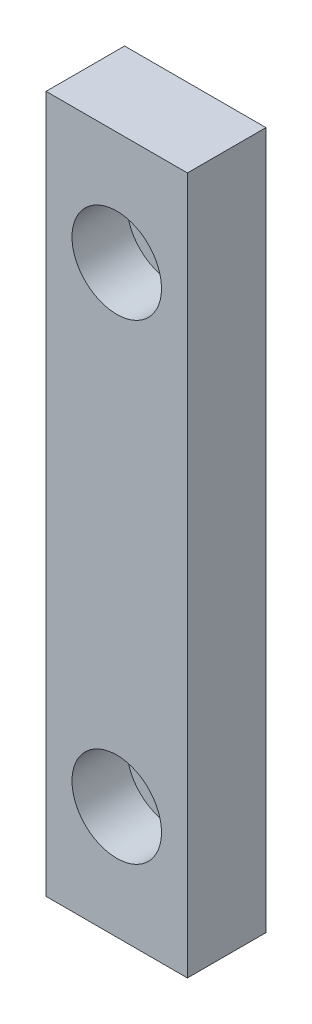
ISO-10303-21;
HEADER;
FILE_DESCRIPTION(('STEP AP214'),'2;1');
FILE_NAME('part.step','',(''),(''),'','','');
FILE_SCHEMA(('AUTOMOTIVE_DESIGN { 1 0 10303 214 1 1 1 1 }'));
ENDSEC;
DATA;
#1=APPLICATION_CONTEXT('core data for automotive mechanical design processes');
#2=APPLICATION_PROTOCOL_DEFINITION('international standard','automotive_design',2000,#1);
#3=PRODUCT_CONTEXT('',#1,'mechanical');
#4=PRODUCT('Part','Part','',(#3));
#5=PRODUCT_RELATED_PRODUCT_CATEGORY('part','',(#4));
#6=PRODUCT_DEFINITION_FORMATION('','',#4);
#7=PRODUCT_DEFINITION_CONTEXT('part definition',#1,'design');
#8=PRODUCT_DEFINITION('design','',#6,#7);
#9=PRODUCT_DEFINITION_SHAPE('','',#8);
#10=(LENGTH_UNIT() NAMED_UNIT(*) SI_UNIT(.MILLI.,.METRE.));
#11=(NAMED_UNIT(*) PLANE_ANGLE_UNIT() SI_UNIT($,.RADIAN.));
#12=(NAMED_UNIT(*) SI_UNIT($,.STERADIAN.) SOLID_ANGLE_UNIT());
#13=UNCERTAINTY_MEASURE_WITH_UNIT(LENGTH_MEASURE(1.E-05),#10,'distance_accuracy_value','');
#14=(GEOMETRIC_REPRESENTATION_CONTEXT(3) GLOBAL_UNCERTAINTY_ASSIGNED_CONTEXT((#13)) GLOBAL_UNIT_ASSIGNED_CONTEXT((#10,
#11,#12)) REPRESENTATION_CONTEXT('',''));
#15=CARTESIAN_POINT('',(0.,0.,0.));
#16=DIRECTION('',(0.,0.,1.));
#17=DIRECTION('',(1.,0.,0.));
#18=AXIS2_PLACEMENT_3D('',#15,#16,#17);
#19=CARTESIAN_POINT('',(0.,22.2,5.));
#20=DIRECTION('',(0.,1.,0.));
#21=DIRECTION('',(0.,0.,1.));
#22=AXIS2_PLACEMENT_3D('',#19,#20,#21);
#23=PLANE('',#22);
#24=DIRECTION('',(1.,0.,0.));
#25=VECTOR('',#24,1.);
#26=CARTESIAN_POINT('',(0.,22.2,0.));
#27=LINE('',#26,#25);
#28=CARTESIAN_POINT('',(-4.5,22.2,0.));
#29=VERTEX_POINT('',#28);
#30=CARTESIAN_POINT('',(4.5,22.2,0.));
#31=VERTEX_POINT('',#30);
#32=EDGE_CURVE('E124',#29,#31,#27,.T.);
#33=ORIENTED_EDGE('',*,*,#32,.F.);
#34=DIRECTION('',(0.,0.,-1.));
#35=VECTOR('',#34,1.);
#36=CARTESIAN_POINT('',(-4.5,22.2,5.));
#37=LINE('',#36,#35);
#38=CARTESIAN_POINT('',(-4.5,22.2,5.));
#39=VERTEX_POINT('',#38);
#40=EDGE_CURVE('E90',#39,#29,#37,.T.);
#41=ORIENTED_EDGE('',*,*,#40,.F.);
#42=DIRECTION('',(1.,0.,0.));
#43=VECTOR('',#42,1.);
#44=CARTESIAN_POINT('',(0.,22.2,5.));
#45=LINE('',#44,#43);
#46=CARTESIAN_POINT('',(4.5,22.2,5.));
#47=VERTEX_POINT('',#46);
#48=EDGE_CURVE('E113',#39,#47,#45,.T.);
#49=ORIENTED_EDGE('',*,*,#48,.T.);
#50=DIRECTION('',(0.,0.,-1.));
#51=VECTOR('',#50,1.);
#52=CARTESIAN_POINT('',(4.5,22.2,5.));
#53=LINE('',#52,#51);
#54=EDGE_CURVE('E87',#47,#31,#53,.T.);
#55=ORIENTED_EDGE('',*,*,#54,.T.);
#56=EDGE_LOOP('',(#33,#41,#49,#55));
#57=FACE_BOUND('',#56,.T.);
#58=ADVANCED_FACE('F45',(#57),#23,.T.);
#59=CARTESIAN_POINT('',(-4.5,0.,5.));
#60=DIRECTION('',(-1.,0.,0.));
#61=DIRECTION('',(0.,0.,1.));
#62=AXIS2_PLACEMENT_3D('',#59,#60,#61);
#63=PLANE('',#62);
#64=DIRECTION('',(0.,1.,0.));
#65=VECTOR('',#64,1.);
#66=CARTESIAN_POINT('',(-4.5,0.,0.));
#67=LINE('',#66,#65);
#68=CARTESIAN_POINT('',(-4.5,-22.2,0.));
#69=VERTEX_POINT('',#68);
#70=EDGE_CURVE('E101',#69,#29,#67,.T.);
#71=ORIENTED_EDGE('',*,*,#70,.F.);
#72=DIRECTION('',(0.,0.,-1.));
#73=VECTOR('',#72,1.);
#74=CARTESIAN_POINT('',(-4.5,-22.2,5.));
#75=LINE('',#74,#73);
#76=CARTESIAN_POINT('',(-4.5,-22.2,5.));
#77=VERTEX_POINT('',#76);
#78=EDGE_CURVE('E95',#77,#69,#75,.T.);
#79=ORIENTED_EDGE('',*,*,#78,.F.);
#80=DIRECTION('',(0.,1.,0.));
#81=VECTOR('',#80,1.);
#82=CARTESIAN_POINT('',(-4.5,0.,5.));
#83=LINE('',#82,#81);
#84=EDGE_CURVE('E99',#77,#39,#83,.T.);
#85=ORIENTED_EDGE('',*,*,#84,.T.);
#86=ORIENTED_EDGE('',*,*,#40,.T.);
#87=EDGE_LOOP('',(#71,#79,#85,#86));
#88=FACE_BOUND('',#87,.T.);
#89=ADVANCED_FACE('F97',(#88),#63,.T.);
#90=CARTESIAN_POINT('',(0.,-22.2,5.));
#91=DIRECTION('',(0.,1.,0.));
#92=DIRECTION('',(0.,0.,1.));
#93=AXIS2_PLACEMENT_3D('',#90,#91,#92);
#94=PLANE('',#93);
#95=DIRECTION('',(1.,0.,0.));
#96=VECTOR('',#95,1.);
#97=CARTESIAN_POINT('',(0.,-22.2,0.));
#98=LINE('',#97,#96);
#99=CARTESIAN_POINT('',(4.5,-22.2,0.));
#100=VERTEX_POINT('',#99);
#101=EDGE_CURVE('E130',#69,#100,#98,.T.);
#102=ORIENTED_EDGE('',*,*,#101,.T.);
#103=DIRECTION('',(0.,0.,-1.));
#104=VECTOR('',#103,1.);
#105=CARTESIAN_POINT('',(4.5,-22.2,5.));
#106=LINE('',#105,#104);
#107=CARTESIAN_POINT('',(4.5,-22.2,5.));
#108=VERTEX_POINT('',#107);
#109=EDGE_CURVE('E105',#108,#100,#106,.T.);
#110=ORIENTED_EDGE('',*,*,#109,.F.);
#111=DIRECTION('',(1.,0.,0.));
#112=VECTOR('',#111,1.);
#113=CARTESIAN_POINT('',(0.,-22.2,5.));
#114=LINE('',#113,#112);
#115=EDGE_CURVE('E108',#77,#108,#114,.T.);
#116=ORIENTED_EDGE('',*,*,#115,.F.);
#117=ORIENTED_EDGE('',*,*,#78,.T.);
#118=EDGE_LOOP('',(#102,#110,#116,#117));
#119=FACE_BOUND('',#118,.T.);
#120=ADVANCED_FACE('F109',(#119),#94,.F.);
#121=CARTESIAN_POINT('',(0.,15.,5.));
#122=DIRECTION('',(0.,0.,-1.));
#123=DIRECTION('',(-1.,0.,0.));
#124=AXIS2_PLACEMENT_3D('',#121,#122,#123);
#125=CYLINDRICAL_SURFACE('',#124,2.85);
#126=CARTESIAN_POINT('',(0.,15.,1.5));
#127=DIRECTION('',(0.,0.,1.));
#128=DIRECTION('',(1.,0.,0.));
#129=AXIS2_PLACEMENT_3D('',#126,#127,#128);
#130=CIRCLE('',#129,2.85);
#131=CARTESIAN_POINT('',(2.85,15.,1.5));
#132=VERTEX_POINT('',#131);
#133=EDGE_CURVE('E11',#132,#132,#130,.T.);
#134=ORIENTED_EDGE('',*,*,#133,.F.);
#135=EDGE_LOOP('',(#134));
#136=FACE_BOUND('',#135,.T.);
#137=CARTESIAN_POINT('',(0.,15.,5.));
#138=DIRECTION('',(0.,0.,1.));
#139=DIRECTION('',(1.,0.,0.));
#140=AXIS2_PLACEMENT_3D('',#137,#138,#139);
#141=CIRCLE('',#140,2.85);
#142=CARTESIAN_POINT('',(2.85,15.,5.));
#143=VERTEX_POINT('',#142);
#144=EDGE_CURVE('E118',#143,#143,#141,.T.);
#145=ORIENTED_EDGE('',*,*,#144,.T.);
#146=EDGE_LOOP('',(#145));
#147=FACE_BOUND('',#146,.T.);
#148=ADVANCED_FACE('F150',(#136,#147),#125,.F.);
#149=CARTESIAN_POINT('',(0.,-15.,5.));
#150=DIRECTION('',(0.,0.,-1.));
#151=DIRECTION('',(-1.,0.,0.));
#152=AXIS2_PLACEMENT_3D('',#149,#150,#151);
#153=CYLINDRICAL_SURFACE('',#152,2.85);
#154=CARTESIAN_POINT('',(0.,-15.,1.5));
#155=DIRECTION('',(0.,0.,1.));
#156=DIRECTION('',(1.,0.,0.));
#157=AXIS2_PLACEMENT_3D('',#154,#155,#156);
#158=CIRCLE('',#157,2.85);
#159=CARTESIAN_POINT('',(2.85,-15.,1.5));
#160=VERTEX_POINT('',#159);
#161=EDGE_CURVE('E55',#160,#160,#158,.T.);
#162=ORIENTED_EDGE('',*,*,#161,.F.);
#163=EDGE_LOOP('',(#162));
#164=FACE_BOUND('',#163,.T.);
#165=CARTESIAN_POINT('',(0.,-15.,5.));
#166=DIRECTION('',(0.,0.,1.));
#167=DIRECTION('',(1.,0.,0.));
#168=AXIS2_PLACEMENT_3D('',#165,#166,#167);
#169=CIRCLE('',#168,2.85);
#170=CARTESIAN_POINT('',(2.85,-15.,5.));
#171=VERTEX_POINT('',#170);
#172=EDGE_CURVE('E135',#171,#171,#169,.T.);
#173=ORIENTED_EDGE('',*,*,#172,.T.);
#174=EDGE_LOOP('',(#173));
#175=FACE_BOUND('',#174,.T.);
#176=ADVANCED_FACE('F47',(#164,#175),#153,.F.);
#177=CARTESIAN_POINT('',(4.5,0.,5.));
#178=DIRECTION('',(-1.,0.,0.));
#179=DIRECTION('',(0.,0.,1.));
#180=AXIS2_PLACEMENT_3D('',#177,#178,#179);
#181=PLANE('',#180);
#182=DIRECTION('',(0.,1.,0.));
#183=VECTOR('',#182,1.);
#184=CARTESIAN_POINT('',(4.5,0.,0.));
#185=LINE('',#184,#183);
#186=EDGE_CURVE('E80',#100,#31,#185,.T.);
#187=ORIENTED_EDGE('',*,*,#186,.T.);
#188=ORIENTED_EDGE('',*,*,#54,.F.);
#189=DIRECTION('',(0.,1.,0.));
#190=VECTOR('',#189,1.);
#191=CARTESIAN_POINT('',(4.5,0.,5.));
#192=LINE('',#191,#190);
#193=EDGE_CURVE('E63',#108,#47,#192,.T.);
#194=ORIENTED_EDGE('',*,*,#193,.F.);
#195=ORIENTED_EDGE('',*,*,#109,.T.);
#196=EDGE_LOOP('',(#187,#188,#194,#195));
#197=FACE_BOUND('',#196,.T.);
#198=ADVANCED_FACE('F149',(#197),#181,.F.);
#199=CARTESIAN_POINT('',(0.,0.,5.));
#200=DIRECTION('',(0.,0.,1.));
#201=DIRECTION('',(1.,0.,0.));
#202=AXIS2_PLACEMENT_3D('',#199,#200,#201);
#203=PLANE('',#202);
#204=ORIENTED_EDGE('',*,*,#172,.F.);
#205=EDGE_LOOP('',(#204));
#206=FACE_BOUND('',#205,.T.);
#207=ORIENTED_EDGE('',*,*,#144,.F.);
#208=EDGE_LOOP('',(#207));
#209=FACE_BOUND('',#208,.T.);
#210=ORIENTED_EDGE('',*,*,#48,.F.);
#211=ORIENTED_EDGE('',*,*,#84,.F.);
#212=ORIENTED_EDGE('',*,*,#115,.T.);
#213=ORIENTED_EDGE('',*,*,#193,.T.);
#214=EDGE_LOOP('',(#210,#211,#212,#213));
#215=FACE_BOUND('',#214,.T.);
#216=ADVANCED_FACE('F112',(#206,#209,#215),#203,.T.);
#217=CARTESIAN_POINT('',(0.,0.,0.));
#218=DIRECTION('',(0.,0.,1.));
#219=DIRECTION('',(1.,0.,0.));
#220=AXIS2_PLACEMENT_3D('',#217,#218,#219);
#221=PLANE('',#220);
#222=ORIENTED_EDGE('',*,*,#32,.T.);
#223=ORIENTED_EDGE('',*,*,#186,.F.);
#224=ORIENTED_EDGE('',*,*,#101,.F.);
#225=ORIENTED_EDGE('',*,*,#70,.T.);
#226=EDGE_LOOP('',(#222,#223,#224,#225));
#227=FACE_BOUND('',#226,.T.);
#228=CARTESIAN_POINT('',(0.,15.,0.));
#229=DIRECTION('',(0.,0.,1.));
#230=DIRECTION('',(1.,0.,0.));
#231=AXIS2_PLACEMENT_3D('',#228,#229,#230);
#232=CIRCLE('',#231,1.6);
#233=CARTESIAN_POINT('',(1.6,15.,0.));
#234=VERTEX_POINT('',#233);
#235=EDGE_CURVE('E160',#234,#234,#232,.T.);
#236=ORIENTED_EDGE('',*,*,#235,.T.);
#237=EDGE_LOOP('',(#236));
#238=FACE_BOUND('',#237,.T.);
#239=CARTESIAN_POINT('',(0.,-15.,0.));
#240=DIRECTION('',(0.,0.,1.));
#241=DIRECTION('',(1.,0.,0.));
#242=AXIS2_PLACEMENT_3D('',#239,#240,#241);
#243=CIRCLE('',#242,1.6);
#244=CARTESIAN_POINT('',(1.6,-15.,0.));
#245=VERTEX_POINT('',#244);
#246=EDGE_CURVE('E167',#245,#245,#243,.T.);
#247=ORIENTED_EDGE('',*,*,#246,.T.);
#248=EDGE_LOOP('',(#247));
#249=FACE_BOUND('',#248,.T.);
#250=ADVANCED_FACE('F198',(#227,#238,#249),#221,.F.);
#251=CARTESIAN_POINT('',(0.,15.,1.5));
#252=DIRECTION('',(0.,0.,-1.));
#253=DIRECTION('',(-1.,0.,0.));
#254=AXIS2_PLACEMENT_3D('',#251,#252,#253);
#255=CYLINDRICAL_SURFACE('',#254,1.6);
#256=CARTESIAN_POINT('',(0.,15.,1.5));
#257=DIRECTION('',(0.,0.,1.));
#258=DIRECTION('',(1.,0.,0.));
#259=AXIS2_PLACEMENT_3D('',#256,#257,#258);
#260=CIRCLE('',#259,1.6);
#261=CARTESIAN_POINT('',(1.6,15.,1.5));
#262=VERTEX_POINT('',#261);
#263=EDGE_CURVE('E163',#262,#262,#260,.T.);
#264=ORIENTED_EDGE('',*,*,#263,.T.);
#265=EDGE_LOOP('',(#264));
#266=FACE_BOUND('',#265,.T.);
#267=ORIENTED_EDGE('',*,*,#235,.F.);
#268=EDGE_LOOP('',(#267));
#269=FACE_BOUND('',#268,.T.);
#270=ADVANCED_FACE('F203',(#266,#269),#255,.F.);
#271=CARTESIAN_POINT('',(0.,0.,1.5));
#272=DIRECTION('',(0.,0.,1.));
#273=DIRECTION('',(1.,0.,0.));
#274=AXIS2_PLACEMENT_3D('',#271,#272,#273);
#275=PLANE('',#274);
#276=ORIENTED_EDGE('',*,*,#133,.T.);
#277=EDGE_LOOP('',(#276));
#278=FACE_BOUND('',#277,.T.);
#279=ORIENTED_EDGE('',*,*,#263,.F.);
#280=EDGE_LOOP('',(#279));
#281=FACE_BOUND('',#280,.T.);
#282=ADVANCED_FACE('F181',(#278,#281),#275,.T.);
#283=CARTESIAN_POINT('',(0.,-15.,1.5));
#284=DIRECTION('',(0.,0.,-1.));
#285=DIRECTION('',(-1.,0.,0.));
#286=AXIS2_PLACEMENT_3D('',#283,#284,#285);
#287=CYLINDRICAL_SURFACE('',#286,1.6);
#288=CARTESIAN_POINT('',(0.,-15.,1.5));
#289=DIRECTION('',(0.,0.,1.));
#290=DIRECTION('',(1.,0.,0.));
#291=AXIS2_PLACEMENT_3D('',#288,#289,#290);
#292=CIRCLE('',#291,1.6);
#293=CARTESIAN_POINT('',(1.6,-15.,1.5));
#294=VERTEX_POINT('',#293);
#295=EDGE_CURVE('E127',#294,#294,#292,.T.);
#296=ORIENTED_EDGE('',*,*,#295,.T.);
#297=EDGE_LOOP('',(#296));
#298=FACE_BOUND('',#297,.T.);
#299=ORIENTED_EDGE('',*,*,#246,.F.);
#300=EDGE_LOOP('',(#299));
#301=FACE_BOUND('',#300,.T.);
#302=ADVANCED_FACE('F174',(#298,#301),#287,.F.);
#303=CARTESIAN_POINT('',(0.,0.,1.5));
#304=DIRECTION('',(0.,0.,1.));
#305=DIRECTION('',(1.,0.,0.));
#306=AXIS2_PLACEMENT_3D('',#303,#304,#305);
#307=PLANE('',#306);
#308=ORIENTED_EDGE('',*,*,#295,.F.);
#309=EDGE_LOOP('',(#308));
#310=FACE_BOUND('',#309,.T.);
#311=ORIENTED_EDGE('',*,*,#161,.T.);
#312=EDGE_LOOP('',(#311));
#313=FACE_BOUND('',#312,.T.);
#314=ADVANCED_FACE('F145',(#310,#313),#307,.T.);
#315=CLOSED_SHELL('',(#58,#89,#120,#148,#176,#198,#216,#250,#270,#282,#302,#314));
#316=MANIFOLD_SOLID_BREP('B2',#315);
#317=ADVANCED_BREP_SHAPE_REPRESENTATION('',(#18,#316),#14);
#318=SHAPE_DEFINITION_REPRESENTATION(#9,#317);
ENDSEC;
END-ISO-10303-21;
